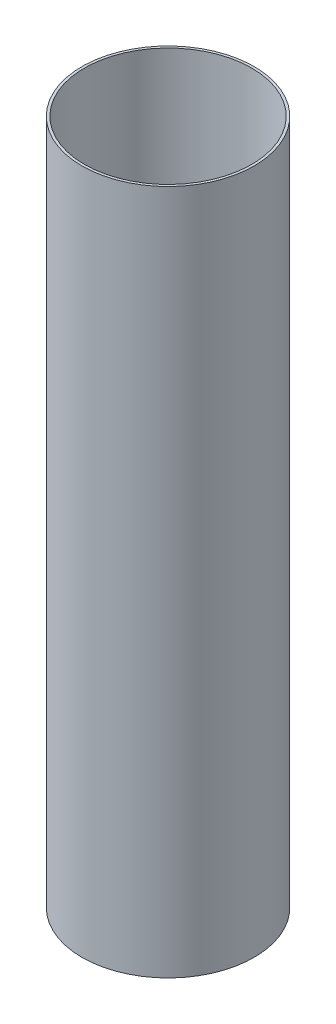
ISO-10303-21;
HEADER;
FILE_DESCRIPTION(('STEP AP214'),'2;1');
FILE_NAME('part.step','',(''),(''),'','','');
FILE_SCHEMA(('AUTOMOTIVE_DESIGN { 1 0 10303 214 1 1 1 1 }'));
ENDSEC;
DATA;
#1=APPLICATION_CONTEXT('core data for automotive mechanical design processes');
#2=APPLICATION_PROTOCOL_DEFINITION('international standard','automotive_design',2000,#1);
#3=PRODUCT_CONTEXT('',#1,'mechanical');
#4=PRODUCT('Part','Part','',(#3));
#5=PRODUCT_RELATED_PRODUCT_CATEGORY('part','',(#4));
#6=PRODUCT_DEFINITION_FORMATION('','',#4);
#7=PRODUCT_DEFINITION_CONTEXT('part definition',#1,'design');
#8=PRODUCT_DEFINITION('design','',#6,#7);
#9=PRODUCT_DEFINITION_SHAPE('','',#8);
#10=(LENGTH_UNIT() NAMED_UNIT(*) SI_UNIT(.MILLI.,.METRE.));
#11=(NAMED_UNIT(*) PLANE_ANGLE_UNIT() SI_UNIT($,.RADIAN.));
#12=(NAMED_UNIT(*) SI_UNIT($,.STERADIAN.) SOLID_ANGLE_UNIT());
#13=UNCERTAINTY_MEASURE_WITH_UNIT(LENGTH_MEASURE(1.E-05),#10,'distance_accuracy_value','');
#14=(GEOMETRIC_REPRESENTATION_CONTEXT(3) GLOBAL_UNCERTAINTY_ASSIGNED_CONTEXT((#13)) GLOBAL_UNIT_ASSIGNED_CONTEXT((#10,
#11,#12)) REPRESENTATION_CONTEXT('',''));
#15=CARTESIAN_POINT('',(0.,0.,0.));
#16=DIRECTION('',(0.,0.,1.));
#17=DIRECTION('',(1.,0.,0.));
#18=AXIS2_PLACEMENT_3D('',#15,#16,#17);
#19=CARTESIAN_POINT('',(0.,260.35,0.));
#20=DIRECTION('',(0.,1.,0.));
#21=DIRECTION('',(0.,0.,1.));
#22=AXIS2_PLACEMENT_3D('',#19,#20,#21);
#23=PLANE('',#22);
#24=CARTESIAN_POINT('',(0.,260.35,0.));
#25=DIRECTION('',(0.,1.,0.));
#26=DIRECTION('',(0.,0.,1.));
#27=AXIS2_PLACEMENT_3D('',#24,#25,#26);
#28=CIRCLE('',#27,65.405);
#29=CARTESIAN_POINT('',(0.,260.35,65.405));
#30=VERTEX_POINT('',#29);
#31=EDGE_CURVE('E10',#30,#30,#28,.T.);
#32=ORIENTED_EDGE('',*,*,#31,.T.);
#33=EDGE_LOOP('',(#32));
#34=FACE_BOUND('',#33,.T.);
#35=CARTESIAN_POINT('',(0.,260.35,0.));
#36=DIRECTION('',(0.,1.,0.));
#37=DIRECTION('',(0.,0.,1.));
#38=AXIS2_PLACEMENT_3D('',#35,#36,#37);
#39=CIRCLE('',#38,63.5);
#40=CARTESIAN_POINT('',(0.,260.35,63.5));
#41=VERTEX_POINT('',#40);
#42=EDGE_CURVE('E46',#41,#41,#39,.T.);
#43=ORIENTED_EDGE('',*,*,#42,.F.);
#44=EDGE_LOOP('',(#43));
#45=FACE_BOUND('',#44,.T.);
#46=ADVANCED_FACE('F35',(#34,#45),#23,.T.);
#47=CARTESIAN_POINT('',(0.,-260.35,0.));
#48=DIRECTION('',(0.,1.,0.));
#49=DIRECTION('',(0.,0.,1.));
#50=AXIS2_PLACEMENT_3D('',#47,#48,#49);
#51=PLANE('',#50);
#52=CARTESIAN_POINT('',(0.,-260.35,0.));
#53=DIRECTION('',(0.,1.,0.));
#54=DIRECTION('',(0.,0.,1.));
#55=AXIS2_PLACEMENT_3D('',#52,#53,#54);
#56=CIRCLE('',#55,65.405);
#57=CARTESIAN_POINT('',(0.,-260.35,65.405));
#58=VERTEX_POINT('',#57);
#59=EDGE_CURVE('E39',#58,#58,#56,.T.);
#60=ORIENTED_EDGE('',*,*,#59,.F.);
#61=EDGE_LOOP('',(#60));
#62=FACE_BOUND('',#61,.T.);
#63=CARTESIAN_POINT('',(0.,-260.35,0.));
#64=DIRECTION('',(0.,1.,0.));
#65=DIRECTION('',(0.,0.,1.));
#66=AXIS2_PLACEMENT_3D('',#63,#64,#65);
#67=CIRCLE('',#66,63.5);
#68=CARTESIAN_POINT('',(0.,-260.35,63.5));
#69=VERTEX_POINT('',#68);
#70=EDGE_CURVE('E48',#69,#69,#67,.T.);
#71=ORIENTED_EDGE('',*,*,#70,.T.);
#72=EDGE_LOOP('',(#71));
#73=FACE_BOUND('',#72,.T.);
#74=ADVANCED_FACE('F58',(#62,#73),#51,.F.);
#75=CARTESIAN_POINT('',(0.,260.35,0.));
#76=DIRECTION('',(0.,-1.,0.));
#77=DIRECTION('',(0.,0.,-1.));
#78=AXIS2_PLACEMENT_3D('',#75,#76,#77);
#79=CYLINDRICAL_SURFACE('',#78,65.405);
#80=ORIENTED_EDGE('',*,*,#31,.F.);
#81=EDGE_LOOP('',(#80));
#82=FACE_BOUND('',#81,.T.);
#83=ORIENTED_EDGE('',*,*,#59,.T.);
#84=EDGE_LOOP('',(#83));
#85=FACE_BOUND('',#84,.T.);
#86=ADVANCED_FACE('F37',(#82,#85),#79,.T.);
#87=CARTESIAN_POINT('',(0.,260.35,0.));
#88=DIRECTION('',(0.,-1.,0.));
#89=DIRECTION('',(0.,0.,-1.));
#90=AXIS2_PLACEMENT_3D('',#87,#88,#89);
#91=CYLINDRICAL_SURFACE('',#90,63.5);
#92=ORIENTED_EDGE('',*,*,#42,.T.);
#93=EDGE_LOOP('',(#92));
#94=FACE_BOUND('',#93,.T.);
#95=ORIENTED_EDGE('',*,*,#70,.F.);
#96=EDGE_LOOP('',(#95));
#97=FACE_BOUND('',#96,.T.);
#98=ADVANCED_FACE('F54',(#94,#97),#91,.F.);
#99=CLOSED_SHELL('',(#46,#74,#86,#98));
#100=MANIFOLD_SOLID_BREP('B2',#99);
#101=ADVANCED_BREP_SHAPE_REPRESENTATION('',(#18,#100),#14);
#102=SHAPE_DEFINITION_REPRESENTATION(#9,#101);
ENDSEC;
END-ISO-10303-21;
